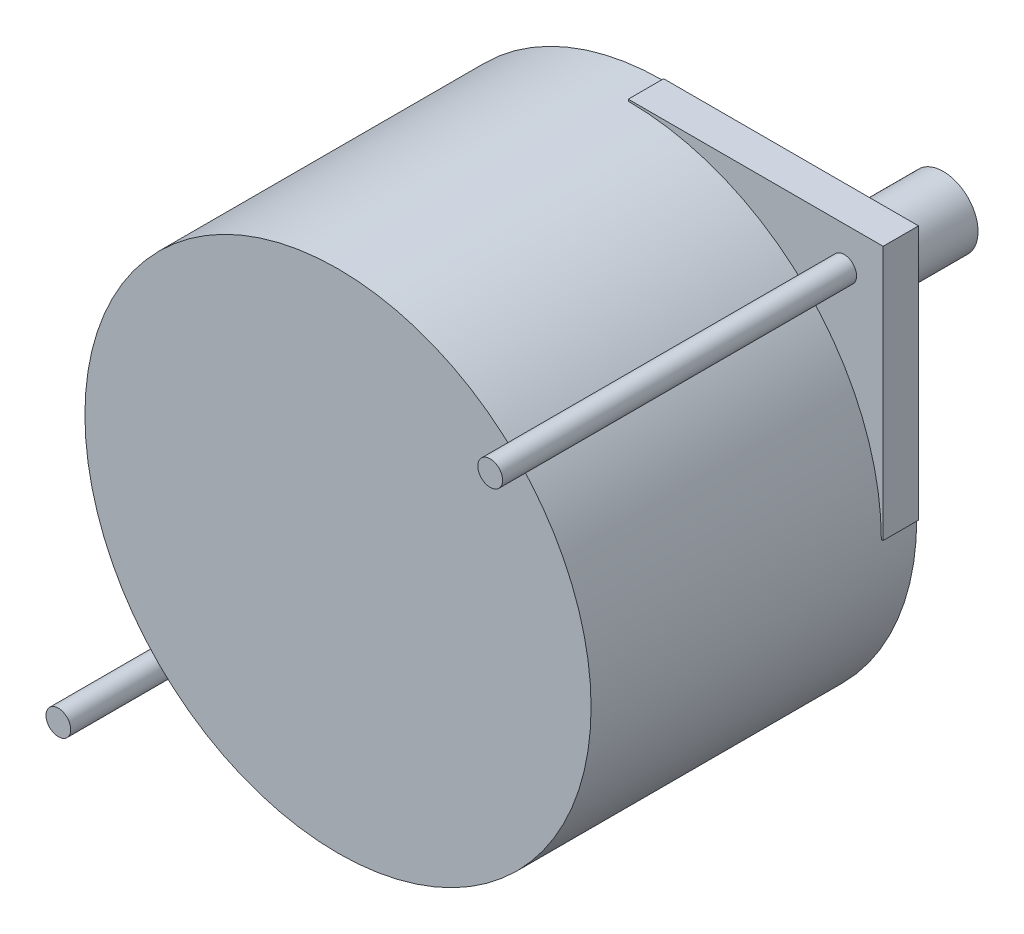
ISO-10303-21;
HEADER;
FILE_DESCRIPTION(('STEP AP214'),'2;1');
FILE_NAME('part.step','',(''),(''),'','','');
FILE_SCHEMA(('AUTOMOTIVE_DESIGN { 1 0 10303 214 1 1 1 1 }'));
ENDSEC;
DATA;
#1=APPLICATION_CONTEXT('core data for automotive mechanical design processes');
#2=APPLICATION_PROTOCOL_DEFINITION('international standard','automotive_design',2000,#1);
#3=PRODUCT_CONTEXT('',#1,'mechanical');
#4=PRODUCT('Part','Part','',(#3));
#5=PRODUCT_RELATED_PRODUCT_CATEGORY('part','',(#4));
#6=PRODUCT_DEFINITION_FORMATION('','',#4);
#7=PRODUCT_DEFINITION_CONTEXT('part definition',#1,'design');
#8=PRODUCT_DEFINITION('design','',#6,#7);
#9=PRODUCT_DEFINITION_SHAPE('','',#8);
#10=(LENGTH_UNIT() NAMED_UNIT(*) SI_UNIT(.MILLI.,.METRE.));
#11=(NAMED_UNIT(*) PLANE_ANGLE_UNIT() SI_UNIT($,.RADIAN.));
#12=(NAMED_UNIT(*) SI_UNIT($,.STERADIAN.) SOLID_ANGLE_UNIT());
#13=UNCERTAINTY_MEASURE_WITH_UNIT(LENGTH_MEASURE(1.E-05),#10,'distance_accuracy_value','');
#14=(GEOMETRIC_REPRESENTATION_CONTEXT(3) GLOBAL_UNCERTAINTY_ASSIGNED_CONTEXT((#13)) GLOBAL_UNIT_ASSIGNED_CONTEXT((#10,
#11,#12)) REPRESENTATION_CONTEXT('',''));
#15=CARTESIAN_POINT('',(0.,0.,0.));
#16=DIRECTION('',(0.,0.,1.));
#17=DIRECTION('',(1.,0.,0.));
#18=AXIS2_PLACEMENT_3D('',#15,#16,#17);
#19=CARTESIAN_POINT('',(0.,0.,2.54));
#20=DIRECTION('',(0.,0.,1.));
#21=DIRECTION('',(1.,0.,0.));
#22=AXIS2_PLACEMENT_3D('',#19,#20,#21);
#23=PLANE('',#22);
#24=CARTESIAN_POINT('',(2.15591616766473,-32.8378083832335,2.54));
#25=DIRECTION('',(0.,0.,1.));
#26=DIRECTION('',(1.,0.,0.));
#27=AXIS2_PLACEMENT_3D('',#24,#25,#26);
#28=CIRCLE('',#27,0.888999999999999);
#29=CARTESIAN_POINT('',(3.04491616766472,-32.8378083832335,2.54));
#30=VERTEX_POINT('',#29);
#31=EDGE_CURVE('E165',#30,#30,#28,.T.);
#32=ORIENTED_EDGE('',*,*,#31,.F.);
#33=EDGE_LOOP('',(#32));
#34=FACE_BOUND('',#33,.T.);
#35=DIRECTION('',(0.,-1.,0.));
#36=VECTOR('',#35,1.);
#37=CARTESIAN_POINT('',(17.6499161676647,-35.6318083832335,2.54));
#38=LINE('',#37,#36);
#39=CARTESIAN_POINT('',(17.6499161676647,-35.5048083832335,2.54));
#40=VERTEX_POINT('',#39);
#41=CARTESIAN_POINT('',(17.6499161676647,-35.6318083832335,2.54));
#42=VERTEX_POINT('',#41);
#43=EDGE_CURVE('E132',#40,#42,#38,.T.);
#44=ORIENTED_EDGE('',*,*,#43,.F.);
#45=CARTESIAN_POINT('',(17.6499161676647,-17.3438083832335,2.54));
#46=DIRECTION('',(0.,0.,1.));
#47=DIRECTION('',(1.,0.,0.));
#48=AXIS2_PLACEMENT_3D('',#45,#46,#47);
#49=CIRCLE('',#48,18.161);
#50=CARTESIAN_POINT('',(-0.511083832335335,-17.3438083832335,2.54));
#51=VERTEX_POINT('',#50);
#52=EDGE_CURVE('E120',#51,#40,#49,.T.);
#53=ORIENTED_EDGE('',*,*,#52,.F.);
#54=DIRECTION('',(1.,0.,0.));
#55=VECTOR('',#54,1.);
#56=CARTESIAN_POINT('',(-0.638083832335327,-17.3438083832335,2.54));
#57=LINE('',#56,#55);
#58=CARTESIAN_POINT('',(-0.638083832335327,-17.3438083832335,2.54));
#59=VERTEX_POINT('',#58);
#60=EDGE_CURVE('E147',#59,#51,#57,.T.);
#61=ORIENTED_EDGE('',*,*,#60,.F.);
#62=DIRECTION('',(0.,-1.,0.));
#63=VECTOR('',#62,1.);
#64=CARTESIAN_POINT('',(-0.638083832335329,0.944191616766467,2.54));
#65=LINE('',#64,#63);
#66=CARTESIAN_POINT('',(-0.638083832335325,-35.6318083832335,2.54));
#67=VERTEX_POINT('',#66);
#68=EDGE_CURVE('E183',#59,#67,#65,.T.);
#69=ORIENTED_EDGE('',*,*,#68,.T.);
#70=DIRECTION('',(1.,0.,0.));
#71=VECTOR('',#70,1.);
#72=CARTESIAN_POINT('',(-0.638083832335325,-35.6318083832335,2.54));
#73=LINE('',#72,#71);
#74=EDGE_CURVE('E185',#67,#42,#73,.T.);
#75=ORIENTED_EDGE('',*,*,#74,.T.);
#76=EDGE_LOOP('',(#44,#53,#61,#69,#75));
#77=FACE_BOUND('',#76,.T.);
#78=ADVANCED_FACE('F33',(#34,#77),#23,.T.);
#79=CARTESIAN_POINT('',(33.1439161676646,-1.84980838323354,2.54));
#80=DIRECTION('',(0.,0.,1.));
#81=DIRECTION('',(1.,0.,0.));
#82=AXIS2_PLACEMENT_3D('',#79,#80,#81);
#83=CIRCLE('',#82,0.889000000000003);
#84=CARTESIAN_POINT('',(34.0329161676646,-1.84980838323354,2.54));
#85=VERTEX_POINT('',#84);
#86=EDGE_CURVE('E174',#85,#85,#83,.T.);
#87=ORIENTED_EDGE('',*,*,#86,.F.);
#88=EDGE_LOOP('',(#87));
#89=FACE_BOUND('',#88,.T.);
#90=DIRECTION('',(0.,1.,0.));
#91=VECTOR('',#90,1.);
#92=CARTESIAN_POINT('',(17.6499161676647,0.944191616766467,2.54));
#93=LINE('',#92,#91);
#94=CARTESIAN_POINT('',(17.6499161676647,0.817191616766473,2.54));
#95=VERTEX_POINT('',#94);
#96=CARTESIAN_POINT('',(17.6499161676647,0.944191616766467,2.54));
#97=VERTEX_POINT('',#96);
#98=EDGE_CURVE('E117',#95,#97,#93,.T.);
#99=ORIENTED_EDGE('',*,*,#98,.F.);
#100=CARTESIAN_POINT('',(35.8109161676647,-17.3438083832335,2.54));
#101=VERTEX_POINT('',#100);
#102=EDGE_CURVE('E111',#101,#95,#49,.T.);
#103=ORIENTED_EDGE('',*,*,#102,.F.);
#104=DIRECTION('',(-1.,0.,0.));
#105=VECTOR('',#104,1.);
#106=CARTESIAN_POINT('',(35.9379161676647,-17.3438083832335,2.54));
#107=LINE('',#106,#105);
#108=CARTESIAN_POINT('',(35.9379161676647,-17.3438083832335,2.54));
#109=VERTEX_POINT('',#108);
#110=EDGE_CURVE('E114',#109,#101,#107,.T.);
#111=ORIENTED_EDGE('',*,*,#110,.F.);
#112=DIRECTION('',(0.,1.,0.));
#113=VECTOR('',#112,1.);
#114=CARTESIAN_POINT('',(35.9379161676647,0.944191616766467,2.54));
#115=LINE('',#114,#113);
#116=CARTESIAN_POINT('',(35.9379161676647,0.944191616766467,2.54));
#117=VERTEX_POINT('',#116);
#118=EDGE_CURVE('E189',#109,#117,#115,.T.);
#119=ORIENTED_EDGE('',*,*,#118,.T.);
#120=DIRECTION('',(-1.,0.,0.));
#121=VECTOR('',#120,1.);
#122=CARTESIAN_POINT('',(-0.638083832335329,0.944191616766467,2.54));
#123=LINE('',#122,#121);
#124=EDGE_CURVE('E191',#117,#97,#123,.T.);
#125=ORIENTED_EDGE('',*,*,#124,.T.);
#126=EDGE_LOOP('',(#99,#103,#111,#119,#125));
#127=FACE_BOUND('',#126,.T.);
#128=ADVANCED_FACE('F112',(#89,#127),#23,.T.);
#129=CARTESIAN_POINT('',(17.6499161676647,-17.3438083832335,-1.016));
#130=DIRECTION('',(0.,0.,-1.));
#131=DIRECTION('',(-1.,0.,0.));
#132=AXIS2_PLACEMENT_3D('',#129,#130,#131);
#133=PLANE('',#132);
#134=CARTESIAN_POINT('',(17.6499161676647,-17.3438083832335,-1.016));
#135=DIRECTION('',(0.,0.,-1.));
#136=DIRECTION('',(-1.,0.,0.));
#137=AXIS2_PLACEMENT_3D('',#134,#135,#136);
#138=CIRCLE('',#137,8.001);
#139=CARTESIAN_POINT('',(9.64891616766467,-17.3438083832335,-1.016));
#140=VERTEX_POINT('',#139);
#141=EDGE_CURVE('E133',#140,#140,#138,.T.);
#142=ORIENTED_EDGE('',*,*,#141,.T.);
#143=EDGE_LOOP('',(#142));
#144=FACE_BOUND('',#143,.T.);
#145=CARTESIAN_POINT('',(17.6499161676647,-17.3438083832335,-1.016));
#146=DIRECTION('',(0.,0.,-1.));
#147=DIRECTION('',(-1.,0.,0.));
#148=AXIS2_PLACEMENT_3D('',#145,#146,#147);
#149=CIRCLE('',#148,2.49555);
#150=CARTESIAN_POINT('',(15.1543661676647,-17.3438083832335,-1.016));
#151=VERTEX_POINT('',#150);
#152=EDGE_CURVE('E221',#151,#151,#149,.T.);
#153=ORIENTED_EDGE('',*,*,#152,.F.);
#154=EDGE_LOOP('',(#153));
#155=FACE_BOUND('',#154,.T.);
#156=ADVANCED_FACE('F250',(#144,#155),#133,.T.);
#157=CARTESIAN_POINT('',(0.,0.,0.));
#158=DIRECTION('',(0.,0.,1.));
#159=DIRECTION('',(1.,0.,0.));
#160=AXIS2_PLACEMENT_3D('',#157,#158,#159);
#161=PLANE('',#160);
#162=CARTESIAN_POINT('',(17.6499161676647,-17.3438083832335,0.));
#163=DIRECTION('',(0.,0.,-1.));
#164=DIRECTION('',(1.,0.,0.));
#165=AXIS2_PLACEMENT_3D('',#162,#163,#164);
#166=CIRCLE('',#165,18.161);
#167=CARTESIAN_POINT('',(35.8109161676647,-17.3438083832335,0.));
#168=VERTEX_POINT('',#167);
#169=CARTESIAN_POINT('',(17.6499161676647,-35.5048083832335,0.));
#170=VERTEX_POINT('',#169);
#171=EDGE_CURVE('E48',#168,#170,#166,.T.);
#172=ORIENTED_EDGE('',*,*,#171,.T.);
#173=DIRECTION('',(0.,-1.,0.));
#174=VECTOR('',#173,1.);
#175=CARTESIAN_POINT('',(17.6499161676647,-35.6318083832335,0.));
#176=LINE('',#175,#174);
#177=CARTESIAN_POINT('',(17.6499161676647,-35.6318083832335,0.));
#178=VERTEX_POINT('',#177);
#179=EDGE_CURVE('E141',#170,#178,#176,.T.);
#180=ORIENTED_EDGE('',*,*,#179,.T.);
#181=DIRECTION('',(1.,0.,0.));
#182=VECTOR('',#181,1.);
#183=CARTESIAN_POINT('',(-0.638083832335325,-35.6318083832335,0.));
#184=LINE('',#183,#182);
#185=CARTESIAN_POINT('',(-0.638083832335325,-35.6318083832335,0.));
#186=VERTEX_POINT('',#185);
#187=EDGE_CURVE('E195',#186,#178,#184,.T.);
#188=ORIENTED_EDGE('',*,*,#187,.F.);
#189=DIRECTION('',(0.,-1.,0.));
#190=VECTOR('',#189,1.);
#191=CARTESIAN_POINT('',(-0.638083832335329,0.944191616766467,0.));
#192=LINE('',#191,#190);
#193=CARTESIAN_POINT('',(-0.638083832335327,-17.3438083832335,0.));
#194=VERTEX_POINT('',#193);
#195=EDGE_CURVE('E180',#194,#186,#192,.T.);
#196=ORIENTED_EDGE('',*,*,#195,.F.);
#197=DIRECTION('',(1.,0.,0.));
#198=VECTOR('',#197,1.);
#199=CARTESIAN_POINT('',(-0.638083832335327,-17.3438083832335,0.));
#200=LINE('',#199,#198);
#201=CARTESIAN_POINT('',(-0.511083832335335,-17.3438083832335,0.));
#202=VERTEX_POINT('',#201);
#203=EDGE_CURVE('E151',#194,#202,#200,.T.);
#204=ORIENTED_EDGE('',*,*,#203,.T.);
#205=CARTESIAN_POINT('',(17.6499161676647,-17.3438083832335,0.));
#206=DIRECTION('',(0.,0.,-1.));
#207=DIRECTION('',(1.,0.,0.));
#208=AXIS2_PLACEMENT_3D('',#205,#206,#207);
#209=CIRCLE('',#208,18.161);
#210=CARTESIAN_POINT('',(17.6499161676647,0.817191616766473,0.));
#211=VERTEX_POINT('',#210);
#212=EDGE_CURVE('E55',#202,#211,#209,.T.);
#213=ORIENTED_EDGE('',*,*,#212,.T.);
#214=DIRECTION('',(0.,1.,0.));
#215=VECTOR('',#214,1.);
#216=CARTESIAN_POINT('',(17.6499161676647,0.944191616766467,0.));
#217=LINE('',#216,#215);
#218=CARTESIAN_POINT('',(17.6499161676647,0.944191616766467,0.));
#219=VERTEX_POINT('',#218);
#220=EDGE_CURVE('E155',#211,#219,#217,.T.);
#221=ORIENTED_EDGE('',*,*,#220,.T.);
#222=DIRECTION('',(-1.,0.,0.));
#223=VECTOR('',#222,1.);
#224=CARTESIAN_POINT('',(-0.638083832335329,0.944191616766467,0.));
#225=LINE('',#224,#223);
#226=CARTESIAN_POINT('',(35.9379161676647,0.944191616766467,0.));
#227=VERTEX_POINT('',#226);
#228=EDGE_CURVE('E186',#227,#219,#225,.T.);
#229=ORIENTED_EDGE('',*,*,#228,.F.);
#230=DIRECTION('',(0.,1.,0.));
#231=VECTOR('',#230,1.);
#232=CARTESIAN_POINT('',(35.9379161676647,0.944191616766467,0.));
#233=LINE('',#232,#231);
#234=CARTESIAN_POINT('',(35.9379161676647,-17.3438083832335,0.));
#235=VERTEX_POINT('',#234);
#236=EDGE_CURVE('E198',#235,#227,#233,.T.);
#237=ORIENTED_EDGE('',*,*,#236,.F.);
#238=DIRECTION('',(-1.,0.,0.));
#239=VECTOR('',#238,1.);
#240=CARTESIAN_POINT('',(35.9379161676647,-17.3438083832335,0.));
#241=LINE('',#240,#239);
#242=EDGE_CURVE('E135',#235,#168,#241,.T.);
#243=ORIENTED_EDGE('',*,*,#242,.T.);
#244=EDGE_LOOP('',(#172,#180,#188,#196,#204,#213,#221,#229,#237,#243));
#245=FACE_BOUND('',#244,.T.);
#246=CARTESIAN_POINT('',(17.6499161676647,-17.3438083832335,0.));
#247=DIRECTION('',(0.,0.,1.));
#248=DIRECTION('',(1.,0.,0.));
#249=AXIS2_PLACEMENT_3D('',#246,#247,#248);
#250=CIRCLE('',#249,8.001);
#251=CARTESIAN_POINT('',(25.6509161676647,-17.3438083832335,0.));
#252=VERTEX_POINT('',#251);
#253=EDGE_CURVE('E11',#252,#252,#250,.F.);
#254=ORIENTED_EDGE('',*,*,#253,.F.);
#255=EDGE_LOOP('',(#254));
#256=FACE_BOUND('',#255,.T.);
#257=ADVANCED_FACE('F215',(#245,#256),#161,.F.);
#258=CARTESIAN_POINT('',(-0.638083832335329,0.944191616766467,2.54));
#259=DIRECTION('',(1.,0.,0.));
#260=DIRECTION('',(0.,1.,0.));
#261=AXIS2_PLACEMENT_3D('',#258,#259,#260);
#262=PLANE('',#261);
#263=ORIENTED_EDGE('',*,*,#68,.F.);
#264=DIRECTION('',(0.,0.,1.));
#265=VECTOR('',#264,1.);
#266=CARTESIAN_POINT('',(-0.638083832335327,-17.3438083832335,0.));
#267=LINE('',#266,#265);
#268=EDGE_CURVE('E158',#194,#59,#267,.T.);
#269=ORIENTED_EDGE('',*,*,#268,.F.);
#270=ORIENTED_EDGE('',*,*,#195,.T.);
#271=DIRECTION('',(0.,0.,-1.));
#272=VECTOR('',#271,1.);
#273=CARTESIAN_POINT('',(-0.638083832335325,-35.6318083832335,2.54));
#274=LINE('',#273,#272);
#275=EDGE_CURVE('E41',#67,#186,#274,.T.);
#276=ORIENTED_EDGE('',*,*,#275,.F.);
#277=EDGE_LOOP('',(#263,#269,#270,#276));
#278=FACE_BOUND('',#277,.T.);
#279=ADVANCED_FACE('F35',(#278),#262,.F.);
#280=CARTESIAN_POINT('',(-0.638083832335325,-35.6318083832335,2.54));
#281=DIRECTION('',(0.,1.,0.));
#282=DIRECTION('',(0.,0.,1.));
#283=AXIS2_PLACEMENT_3D('',#280,#281,#282);
#284=PLANE('',#283);
#285=ORIENTED_EDGE('',*,*,#187,.T.);
#286=DIRECTION('',(0.,0.,1.));
#287=VECTOR('',#286,1.);
#288=CARTESIAN_POINT('',(17.6499161676647,-35.6318083832335,0.));
#289=LINE('',#288,#287);
#290=EDGE_CURVE('E144',#178,#42,#289,.T.);
#291=ORIENTED_EDGE('',*,*,#290,.T.);
#292=ORIENTED_EDGE('',*,*,#74,.F.);
#293=ORIENTED_EDGE('',*,*,#275,.T.);
#294=EDGE_LOOP('',(#285,#291,#292,#293));
#295=FACE_BOUND('',#294,.T.);
#296=ADVANCED_FACE('F207',(#295),#284,.F.);
#297=CARTESIAN_POINT('',(35.9379161676647,0.944191616766467,2.54));
#298=DIRECTION('',(-1.,0.,0.));
#299=DIRECTION('',(0.,-1.,0.));
#300=AXIS2_PLACEMENT_3D('',#297,#298,#299);
#301=PLANE('',#300);
#302=ORIENTED_EDGE('',*,*,#118,.F.);
#303=DIRECTION('',(0.,0.,1.));
#304=VECTOR('',#303,1.);
#305=CARTESIAN_POINT('',(35.9379161676647,-17.3438083832335,0.));
#306=LINE('',#305,#304);
#307=EDGE_CURVE('E128',#235,#109,#306,.T.);
#308=ORIENTED_EDGE('',*,*,#307,.F.);
#309=ORIENTED_EDGE('',*,*,#236,.T.);
#310=DIRECTION('',(0.,0.,-1.));
#311=VECTOR('',#310,1.);
#312=CARTESIAN_POINT('',(35.9379161676647,0.944191616766467,2.54));
#313=LINE('',#312,#311);
#314=EDGE_CURVE('E193',#117,#227,#313,.T.);
#315=ORIENTED_EDGE('',*,*,#314,.F.);
#316=EDGE_LOOP('',(#302,#308,#309,#315));
#317=FACE_BOUND('',#316,.T.);
#318=ADVANCED_FACE('F263',(#317),#301,.F.);
#319=CARTESIAN_POINT('',(-0.638083832335329,0.944191616766467,2.54));
#320=DIRECTION('',(0.,-1.,0.));
#321=DIRECTION('',(0.,0.,-1.));
#322=AXIS2_PLACEMENT_3D('',#319,#320,#321);
#323=PLANE('',#322);
#324=ORIENTED_EDGE('',*,*,#228,.T.);
#325=DIRECTION('',(0.,0.,1.));
#326=VECTOR('',#325,1.);
#327=CARTESIAN_POINT('',(17.6499161676647,0.944191616766467,0.));
#328=LINE('',#327,#326);
#329=EDGE_CURVE('E162',#219,#97,#328,.T.);
#330=ORIENTED_EDGE('',*,*,#329,.T.);
#331=ORIENTED_EDGE('',*,*,#124,.F.);
#332=ORIENTED_EDGE('',*,*,#314,.T.);
#333=EDGE_LOOP('',(#324,#330,#331,#332));
#334=FACE_BOUND('',#333,.T.);
#335=ADVANCED_FACE('F260',(#334),#323,.F.);
#336=CARTESIAN_POINT('',(33.1439161676646,-1.84980838323354,27.94));
#337=DIRECTION('',(0.,0.,-1.));
#338=DIRECTION('',(-1.,0.,0.));
#339=AXIS2_PLACEMENT_3D('',#336,#337,#338);
#340=CYLINDRICAL_SURFACE('',#339,0.889000000000003);
#341=CARTESIAN_POINT('',(33.1439161676646,-1.84980838323354,27.94));
#342=DIRECTION('',(0.,0.,1.));
#343=DIRECTION('',(1.,0.,0.));
#344=AXIS2_PLACEMENT_3D('',#341,#342,#343);
#345=CIRCLE('',#344,0.889000000000003);
#346=CARTESIAN_POINT('',(34.0329161676646,-1.84980838323354,27.94));
#347=VERTEX_POINT('',#346);
#348=EDGE_CURVE('E177',#347,#347,#345,.T.);
#349=ORIENTED_EDGE('',*,*,#348,.F.);
#350=EDGE_LOOP('',(#349));
#351=FACE_BOUND('',#350,.T.);
#352=ORIENTED_EDGE('',*,*,#86,.T.);
#353=EDGE_LOOP('',(#352));
#354=FACE_BOUND('',#353,.T.);
#355=ADVANCED_FACE('F256',(#351,#354),#340,.T.);
#356=CARTESIAN_POINT('',(33.1439161676646,-1.84980838323354,27.94));
#357=DIRECTION('',(0.,0.,1.));
#358=DIRECTION('',(1.,0.,0.));
#359=AXIS2_PLACEMENT_3D('',#356,#357,#358);
#360=PLANE('',#359);
#361=ORIENTED_EDGE('',*,*,#348,.T.);
#362=EDGE_LOOP('',(#361));
#363=FACE_BOUND('',#362,.T.);
#364=ADVANCED_FACE('F403',(#363),#360,.T.);
#365=CARTESIAN_POINT('',(2.15591616766473,-32.8378083832335,27.94));
#366=DIRECTION('',(0.,0.,-1.));
#367=DIRECTION('',(-1.,0.,0.));
#368=AXIS2_PLACEMENT_3D('',#365,#366,#367);
#369=CYLINDRICAL_SURFACE('',#368,0.888999999999999);
#370=CARTESIAN_POINT('',(2.15591616766473,-32.8378083832335,27.94));
#371=DIRECTION('',(0.,0.,1.));
#372=DIRECTION('',(1.,0.,0.));
#373=AXIS2_PLACEMENT_3D('',#370,#371,#372);
#374=CIRCLE('',#373,0.888999999999999);
#375=CARTESIAN_POINT('',(3.04491616766472,-32.8378083832335,27.94));
#376=VERTEX_POINT('',#375);
#377=EDGE_CURVE('E171',#376,#376,#374,.T.);
#378=ORIENTED_EDGE('',*,*,#377,.F.);
#379=EDGE_LOOP('',(#378));
#380=FACE_BOUND('',#379,.T.);
#381=ORIENTED_EDGE('',*,*,#31,.T.);
#382=EDGE_LOOP('',(#381));
#383=FACE_BOUND('',#382,.T.);
#384=ADVANCED_FACE('F396',(#380,#383),#369,.T.);
#385=CARTESIAN_POINT('',(2.15591616766473,-32.8378083832335,27.94));
#386=DIRECTION('',(0.,0.,1.));
#387=DIRECTION('',(1.,0.,0.));
#388=AXIS2_PLACEMENT_3D('',#385,#386,#387);
#389=PLANE('',#388);
#390=ORIENTED_EDGE('',*,*,#377,.T.);
#391=EDGE_LOOP('',(#390));
#392=FACE_BOUND('',#391,.T.);
#393=ADVANCED_FACE('F241',(#392),#389,.T.);
#394=CARTESIAN_POINT('',(17.6499161676647,0.944191616766467,0.));
#395=DIRECTION('',(1.,0.,0.));
#396=DIRECTION('',(0.,0.,-1.));
#397=AXIS2_PLACEMENT_3D('',#394,#395,#396);
#398=PLANE('',#397);
#399=ORIENTED_EDGE('',*,*,#98,.T.);
#400=ORIENTED_EDGE('',*,*,#329,.F.);
#401=ORIENTED_EDGE('',*,*,#220,.F.);
#402=DIRECTION('',(0.,0.,1.));
#403=VECTOR('',#402,1.);
#404=CARTESIAN_POINT('',(17.6499161676647,0.817191616766473,0.));
#405=LINE('',#404,#403);
#406=EDGE_CURVE('E166',#211,#95,#405,.T.);
#407=ORIENTED_EDGE('',*,*,#406,.T.);
#408=EDGE_LOOP('',(#399,#400,#401,#407));
#409=FACE_BOUND('',#408,.T.);
#410=ADVANCED_FACE('F232',(#409),#398,.F.);
#411=CARTESIAN_POINT('',(17.6499161676647,-17.3438083832335,0.));
#412=DIRECTION('',(0.,0.,1.));
#413=DIRECTION('',(1.,0.,0.));
#414=AXIS2_PLACEMENT_3D('',#411,#412,#413);
#415=CYLINDRICAL_SURFACE('',#414,18.161);
#416=DIRECTION('',(0.,0.,1.));
#417=VECTOR('',#416,1.);
#418=CARTESIAN_POINT('',(-0.511083832335335,-17.3438083832335,0.));
#419=LINE('',#418,#417);
#420=EDGE_CURVE('E168',#202,#51,#419,.T.);
#421=ORIENTED_EDGE('',*,*,#420,.T.);
#422=ORIENTED_EDGE('',*,*,#52,.T.);
#423=DIRECTION('',(0.,0.,1.));
#424=VECTOR('',#423,1.);
#425=CARTESIAN_POINT('',(17.6499161676647,-35.5048083832335,0.));
#426=LINE('',#425,#424);
#427=EDGE_CURVE('E127',#170,#40,#426,.T.);
#428=ORIENTED_EDGE('',*,*,#427,.F.);
#429=ORIENTED_EDGE('',*,*,#171,.F.);
#430=DIRECTION('',(0.,0.,1.));
#431=VECTOR('',#430,1.);
#432=CARTESIAN_POINT('',(35.8109161676647,-17.3438083832335,0.));
#433=LINE('',#432,#431);
#434=EDGE_CURVE('E122',#168,#101,#433,.T.);
#435=ORIENTED_EDGE('',*,*,#434,.T.);
#436=ORIENTED_EDGE('',*,*,#102,.T.);
#437=ORIENTED_EDGE('',*,*,#406,.F.);
#438=ORIENTED_EDGE('',*,*,#212,.F.);
#439=EDGE_LOOP('',(#421,#422,#428,#429,#435,#436,#437,#438));
#440=FACE_BOUND('',#439,.T.);
#441=CARTESIAN_POINT('',(17.6499161676647,-17.3438083832335,23.368));
#442=DIRECTION('',(0.,0.,1.));
#443=DIRECTION('',(1.,0.,0.));
#444=AXIS2_PLACEMENT_3D('',#441,#442,#443);
#445=CIRCLE('',#444,18.161);
#446=CARTESIAN_POINT('',(35.8109161676647,-17.3438083832335,23.368));
#447=VERTEX_POINT('',#446);
#448=EDGE_CURVE('E119',#447,#447,#445,.T.);
#449=ORIENTED_EDGE('',*,*,#448,.F.);
#450=EDGE_LOOP('',(#449));
#451=FACE_BOUND('',#450,.T.);
#452=ADVANCED_FACE('F123',(#440,#451),#415,.T.);
#453=CARTESIAN_POINT('',(-0.638083832335327,-17.3438083832335,0.));
#454=DIRECTION('',(0.,-1.,0.));
#455=DIRECTION('',(0.,0.,-1.));
#456=AXIS2_PLACEMENT_3D('',#453,#454,#455);
#457=PLANE('',#456);
#458=ORIENTED_EDGE('',*,*,#60,.T.);
#459=ORIENTED_EDGE('',*,*,#420,.F.);
#460=ORIENTED_EDGE('',*,*,#203,.F.);
#461=ORIENTED_EDGE('',*,*,#268,.T.);
#462=EDGE_LOOP('',(#458,#459,#460,#461));
#463=FACE_BOUND('',#462,.T.);
#464=ADVANCED_FACE('F231',(#463),#457,.F.);
#465=CARTESIAN_POINT('',(17.6499161676647,-35.6318083832335,0.));
#466=DIRECTION('',(-1.,0.,0.));
#467=DIRECTION('',(0.,-1.,0.));
#468=AXIS2_PLACEMENT_3D('',#465,#466,#467);
#469=PLANE('',#468);
#470=ORIENTED_EDGE('',*,*,#43,.T.);
#471=ORIENTED_EDGE('',*,*,#290,.F.);
#472=ORIENTED_EDGE('',*,*,#179,.F.);
#473=ORIENTED_EDGE('',*,*,#427,.T.);
#474=EDGE_LOOP('',(#470,#471,#472,#473));
#475=FACE_BOUND('',#474,.T.);
#476=ADVANCED_FACE('F238',(#475),#469,.F.);
#477=CARTESIAN_POINT('',(35.9379161676647,-17.3438083832335,0.));
#478=DIRECTION('',(0.,1.,0.));
#479=DIRECTION('',(0.,0.,1.));
#480=AXIS2_PLACEMENT_3D('',#477,#478,#479);
#481=PLANE('',#480);
#482=ORIENTED_EDGE('',*,*,#110,.T.);
#483=ORIENTED_EDGE('',*,*,#434,.F.);
#484=ORIENTED_EDGE('',*,*,#242,.F.);
#485=ORIENTED_EDGE('',*,*,#307,.T.);
#486=EDGE_LOOP('',(#482,#483,#484,#485));
#487=FACE_BOUND('',#486,.T.);
#488=ADVANCED_FACE('F130',(#487),#481,.F.);
#489=CARTESIAN_POINT('',(17.6499161676647,-17.3438083832335,-1.016));
#490=DIRECTION('',(0.,0.,1.));
#491=DIRECTION('',(1.,0.,0.));
#492=AXIS2_PLACEMENT_3D('',#489,#490,#491);
#493=CYLINDRICAL_SURFACE('',#492,8.001);
#494=ORIENTED_EDGE('',*,*,#141,.F.);
#495=EDGE_LOOP('',(#494));
#496=FACE_BOUND('',#495,.T.);
#497=ORIENTED_EDGE('',*,*,#253,.T.);
#498=EDGE_LOOP('',(#497));
#499=FACE_BOUND('',#498,.T.);
#500=ADVANCED_FACE('F334',(#496,#499),#493,.T.);
#501=CARTESIAN_POINT('',(17.6499161676647,-17.3438083832335,-20.066));
#502=DIRECTION('',(0.,0.,1.));
#503=DIRECTION('',(1.,0.,0.));
#504=AXIS2_PLACEMENT_3D('',#501,#502,#503);
#505=CYLINDRICAL_SURFACE('',#504,2.49555);
#506=CARTESIAN_POINT('',(17.6499161676647,-17.3438083832335,-20.066));
#507=DIRECTION('',(0.,0.,-1.));
#508=DIRECTION('',(-1.,0.,0.));
#509=AXIS2_PLACEMENT_3D('',#506,#507,#508);
#510=CIRCLE('',#509,2.49555);
#511=CARTESIAN_POINT('',(15.1543661676647,-17.3438083832335,-20.066));
#512=VERTEX_POINT('',#511);
#513=EDGE_CURVE('E138',#512,#512,#510,.T.);
#514=ORIENTED_EDGE('',*,*,#513,.F.);
#515=EDGE_LOOP('',(#514));
#516=FACE_BOUND('',#515,.T.);
#517=ORIENTED_EDGE('',*,*,#152,.T.);
#518=EDGE_LOOP('',(#517));
#519=FACE_BOUND('',#518,.T.);
#520=ADVANCED_FACE('F350',(#516,#519),#505,.T.);
#521=CARTESIAN_POINT('',(17.6499161676647,-17.3438083832335,-20.066));
#522=DIRECTION('',(0.,0.,-1.));
#523=DIRECTION('',(-1.,0.,0.));
#524=AXIS2_PLACEMENT_3D('',#521,#522,#523);
#525=PLANE('',#524);
#526=ORIENTED_EDGE('',*,*,#513,.T.);
#527=EDGE_LOOP('',(#526));
#528=FACE_BOUND('',#527,.T.);
#529=ADVANCED_FACE('F342',(#528),#525,.T.);
#530=CARTESIAN_POINT('',(17.6499161676647,-17.3438083832335,23.368));
#531=DIRECTION('',(0.,0.,1.));
#532=DIRECTION('',(1.,0.,0.));
#533=AXIS2_PLACEMENT_3D('',#530,#531,#532);
#534=PLANE('',#533);
#535=ORIENTED_EDGE('',*,*,#448,.T.);
#536=EDGE_LOOP('',(#535));
#537=FACE_BOUND('',#536,.T.);
#538=ADVANCED_FACE('F229',(#537),#534,.T.);
#539=CLOSED_SHELL('',(#78,#128,#156,#257,#279,#296,#318,#335,#355,#364,#384,#393,#410,#452,#464,
#476,#488,#500,#520,#529,#538));
#540=MANIFOLD_SOLID_BREP('B2',#539);
#541=ADVANCED_BREP_SHAPE_REPRESENTATION('',(#18,#540),#14);
#542=SHAPE_DEFINITION_REPRESENTATION(#9,#541);
ENDSEC;
END-ISO-10303-21;
